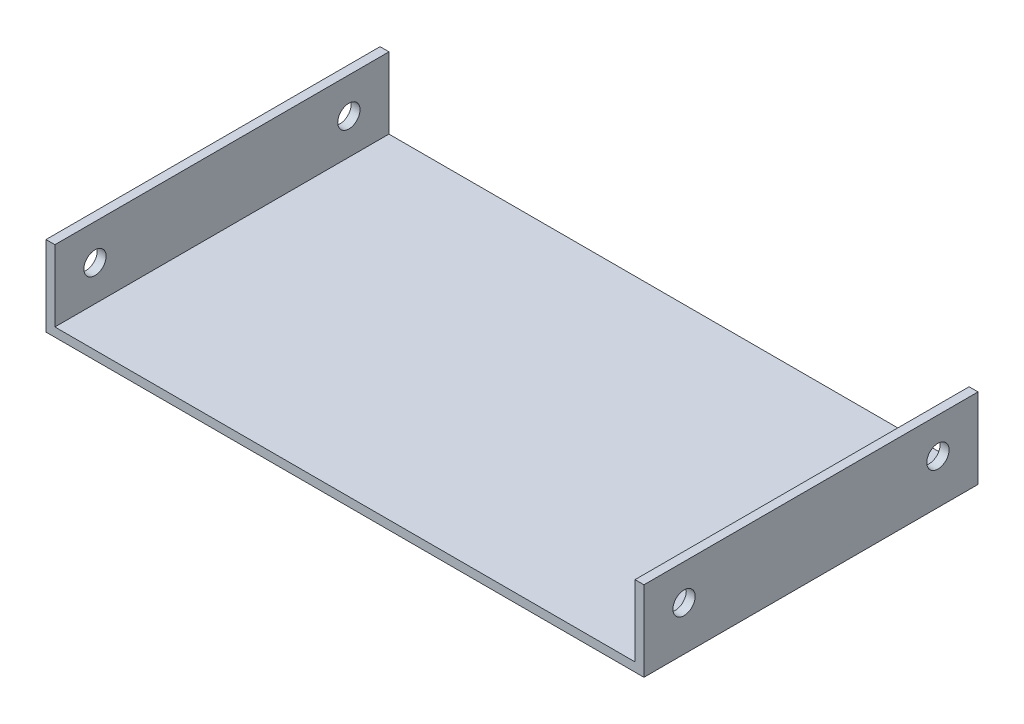
ISO-10303-21;
HEADER;
FILE_DESCRIPTION(('STEP AP214'),'2;1');
FILE_NAME('part.step','',(''),(''),'','','');
FILE_SCHEMA(('AUTOMOTIVE_DESIGN { 1 0 10303 214 1 1 1 1 }'));
ENDSEC;
DATA;
#1=APPLICATION_CONTEXT('core data for automotive mechanical design processes');
#2=APPLICATION_PROTOCOL_DEFINITION('international standard','automotive_design',2000,#1);
#3=PRODUCT_CONTEXT('',#1,'mechanical');
#4=PRODUCT('Part','Part','',(#3));
#5=PRODUCT_RELATED_PRODUCT_CATEGORY('part','',(#4));
#6=PRODUCT_DEFINITION_FORMATION('','',#4);
#7=PRODUCT_DEFINITION_CONTEXT('part definition',#1,'design');
#8=PRODUCT_DEFINITION('design','',#6,#7);
#9=PRODUCT_DEFINITION_SHAPE('','',#8);
#10=(LENGTH_UNIT() NAMED_UNIT(*) SI_UNIT(.MILLI.,.METRE.));
#11=(NAMED_UNIT(*) PLANE_ANGLE_UNIT() SI_UNIT($,.RADIAN.));
#12=(NAMED_UNIT(*) SI_UNIT($,.STERADIAN.) SOLID_ANGLE_UNIT());
#13=UNCERTAINTY_MEASURE_WITH_UNIT(LENGTH_MEASURE(1.E-05),#10,'distance_accuracy_value','');
#14=(GEOMETRIC_REPRESENTATION_CONTEXT(3) GLOBAL_UNCERTAINTY_ASSIGNED_CONTEXT((#13)) GLOBAL_UNIT_ASSIGNED_CONTEXT((#10,
#11,#12)) REPRESENTATION_CONTEXT('',''));
#15=CARTESIAN_POINT('',(0.,0.,0.));
#16=DIRECTION('',(0.,0.,1.));
#17=DIRECTION('',(1.,0.,0.));
#18=AXIS2_PLACEMENT_3D('',#15,#16,#17);
#19=CARTESIAN_POINT('',(-65.125,2.,-37.5));
#20=DIRECTION('',(0.,0.,1.));
#21=DIRECTION('',(1.,0.,0.));
#22=AXIS2_PLACEMENT_3D('',#19,#20,#21);
#23=PLANE('',#22);
#24=DIRECTION('',(-1.,0.,0.));
#25=VECTOR('',#24,1.);
#26=CARTESIAN_POINT('',(-65.125,0.,-37.5));
#27=LINE('',#26,#25);
#28=CARTESIAN_POINT('',(67.125,0.,-37.5));
#29=VERTEX_POINT('',#28);
#30=CARTESIAN_POINT('',(-67.125,0.,-37.5));
#31=VERTEX_POINT('',#30);
#32=EDGE_CURVE('E107',#29,#31,#27,.T.);
#33=ORIENTED_EDGE('',*,*,#32,.T.);
#34=DIRECTION('',(0.,1.,0.));
#35=VECTOR('',#34,1.);
#36=CARTESIAN_POINT('',(-67.125,0.,-37.5));
#37=LINE('',#36,#35);
#38=CARTESIAN_POINT('',(-67.125,18.,-37.5));
#39=VERTEX_POINT('',#38);
#40=EDGE_CURVE('E110',#31,#39,#37,.T.);
#41=ORIENTED_EDGE('',*,*,#40,.T.);
#42=DIRECTION('',(1.,0.,0.));
#43=VECTOR('',#42,1.);
#44=CARTESIAN_POINT('',(-67.125,18.,-37.5));
#45=LINE('',#44,#43);
#46=CARTESIAN_POINT('',(-65.125,18.,-37.5));
#47=VERTEX_POINT('',#46);
#48=EDGE_CURVE('E144',#39,#47,#45,.T.);
#49=ORIENTED_EDGE('',*,*,#48,.T.);
#50=DIRECTION('',(0.,1.,0.));
#51=VECTOR('',#50,1.);
#52=CARTESIAN_POINT('',(-65.125,0.,-37.5));
#53=LINE('',#52,#51);
#54=CARTESIAN_POINT('',(-65.125,2.,-37.5));
#55=VERTEX_POINT('',#54);
#56=EDGE_CURVE('E145',#55,#47,#53,.T.);
#57=ORIENTED_EDGE('',*,*,#56,.F.);
#58=DIRECTION('',(-1.,0.,0.));
#59=VECTOR('',#58,1.);
#60=CARTESIAN_POINT('',(-65.125,2.,-37.5));
#61=LINE('',#60,#59);
#62=CARTESIAN_POINT('',(65.125,2.,-37.5));
#63=VERTEX_POINT('',#62);
#64=EDGE_CURVE('E190',#63,#55,#61,.T.);
#65=ORIENTED_EDGE('',*,*,#64,.F.);
#66=DIRECTION('',(0.,1.,0.));
#67=VECTOR('',#66,1.);
#68=CARTESIAN_POINT('',(65.125,0.,-37.5));
#69=LINE('',#68,#67);
#70=CARTESIAN_POINT('',(65.125,18.,-37.5));
#71=VERTEX_POINT('',#70);
#72=EDGE_CURVE('E64',#63,#71,#69,.T.);
#73=ORIENTED_EDGE('',*,*,#72,.T.);
#74=DIRECTION('',(-1.,0.,0.));
#75=VECTOR('',#74,1.);
#76=CARTESIAN_POINT('',(67.125,18.,-37.5));
#77=LINE('',#76,#75);
#78=CARTESIAN_POINT('',(67.125,18.,-37.5));
#79=VERTEX_POINT('',#78);
#80=EDGE_CURVE('E121',#79,#71,#77,.T.);
#81=ORIENTED_EDGE('',*,*,#80,.F.);
#82=DIRECTION('',(0.,1.,0.));
#83=VECTOR('',#82,1.);
#84=CARTESIAN_POINT('',(67.125,0.,-37.5));
#85=LINE('',#84,#83);
#86=EDGE_CURVE('E114',#29,#79,#85,.T.);
#87=ORIENTED_EDGE('',*,*,#86,.F.);
#88=EDGE_LOOP('',(#33,#41,#49,#57,#65,#73,#81,#87));
#89=FACE_BOUND('',#88,.T.);
#90=ADVANCED_FACE('F39',(#89),#23,.F.);
#91=CARTESIAN_POINT('',(-65.125,2.,37.5));
#92=DIRECTION('',(0.,0.,-1.));
#93=DIRECTION('',(-1.,0.,0.));
#94=AXIS2_PLACEMENT_3D('',#91,#92,#93);
#95=PLANE('',#94);
#96=DIRECTION('',(1.,0.,0.));
#97=VECTOR('',#96,1.);
#98=CARTESIAN_POINT('',(-65.125,0.,37.5));
#99=LINE('',#98,#97);
#100=CARTESIAN_POINT('',(-67.125,0.,37.5));
#101=VERTEX_POINT('',#100);
#102=CARTESIAN_POINT('',(67.125,0.,37.5));
#103=VERTEX_POINT('',#102);
#104=EDGE_CURVE('E120',#101,#103,#99,.T.);
#105=ORIENTED_EDGE('',*,*,#104,.T.);
#106=DIRECTION('',(0.,-1.,0.));
#107=VECTOR('',#106,1.);
#108=CARTESIAN_POINT('',(67.125,0.,37.5));
#109=LINE('',#108,#107);
#110=CARTESIAN_POINT('',(67.125,18.,37.5));
#111=VERTEX_POINT('',#110);
#112=EDGE_CURVE('E164',#111,#103,#109,.T.);
#113=ORIENTED_EDGE('',*,*,#112,.F.);
#114=DIRECTION('',(-1.,0.,0.));
#115=VECTOR('',#114,1.);
#116=CARTESIAN_POINT('',(67.125,18.,37.5));
#117=LINE('',#116,#115);
#118=CARTESIAN_POINT('',(65.125,18.,37.5));
#119=VERTEX_POINT('',#118);
#120=EDGE_CURVE('E171',#111,#119,#117,.T.);
#121=ORIENTED_EDGE('',*,*,#120,.T.);
#122=DIRECTION('',(0.,-1.,0.));
#123=VECTOR('',#122,1.);
#124=CARTESIAN_POINT('',(65.125,0.,37.5));
#125=LINE('',#124,#123);
#126=CARTESIAN_POINT('',(65.125,2.,37.5));
#127=VERTEX_POINT('',#126);
#128=EDGE_CURVE('E161',#119,#127,#125,.T.);
#129=ORIENTED_EDGE('',*,*,#128,.T.);
#130=DIRECTION('',(1.,0.,0.));
#131=VECTOR('',#130,1.);
#132=CARTESIAN_POINT('',(-65.125,2.,37.5));
#133=LINE('',#132,#131);
#134=CARTESIAN_POINT('',(-65.125,2.,37.5));
#135=VERTEX_POINT('',#134);
#136=EDGE_CURVE('E11',#135,#127,#133,.T.);
#137=ORIENTED_EDGE('',*,*,#136,.F.);
#138=DIRECTION('',(0.,-1.,0.));
#139=VECTOR('',#138,1.);
#140=CARTESIAN_POINT('',(-65.125,0.,37.5));
#141=LINE('',#140,#139);
#142=CARTESIAN_POINT('',(-65.125,18.,37.5));
#143=VERTEX_POINT('',#142);
#144=EDGE_CURVE('E56',#143,#135,#141,.T.);
#145=ORIENTED_EDGE('',*,*,#144,.F.);
#146=DIRECTION('',(1.,0.,0.));
#147=VECTOR('',#146,1.);
#148=CARTESIAN_POINT('',(-67.125,18.,37.5));
#149=LINE('',#148,#147);
#150=CARTESIAN_POINT('',(-67.125,18.,37.5));
#151=VERTEX_POINT('',#150);
#152=EDGE_CURVE('E155',#151,#143,#149,.T.);
#153=ORIENTED_EDGE('',*,*,#152,.F.);
#154=DIRECTION('',(0.,-1.,0.));
#155=VECTOR('',#154,1.);
#156=CARTESIAN_POINT('',(-67.125,0.,37.5));
#157=LINE('',#156,#155);
#158=EDGE_CURVE('E136',#151,#101,#157,.T.);
#159=ORIENTED_EDGE('',*,*,#158,.T.);
#160=EDGE_LOOP('',(#105,#113,#121,#129,#137,#145,#153,#159));
#161=FACE_BOUND('',#160,.T.);
#162=ADVANCED_FACE('F251',(#161),#95,.F.);
#163=CARTESIAN_POINT('',(0.,2.,0.));
#164=DIRECTION('',(0.,-1.,0.));
#165=DIRECTION('',(0.,0.,-1.));
#166=AXIS2_PLACEMENT_3D('',#163,#164,#165);
#167=PLANE('',#166);
#168=DIRECTION('',(0.,0.,-1.));
#169=VECTOR('',#168,1.);
#170=CARTESIAN_POINT('',(65.125,2.,37.5));
#171=LINE('',#170,#169);
#172=EDGE_CURVE('E186',#127,#63,#171,.T.);
#173=ORIENTED_EDGE('',*,*,#172,.T.);
#174=ORIENTED_EDGE('',*,*,#64,.T.);
#175=DIRECTION('',(0.,0.,1.));
#176=VECTOR('',#175,1.);
#177=CARTESIAN_POINT('',(-65.125,2.,37.5));
#178=LINE('',#177,#176);
#179=EDGE_CURVE('E48',#55,#135,#178,.T.);
#180=ORIENTED_EDGE('',*,*,#179,.T.);
#181=ORIENTED_EDGE('',*,*,#136,.T.);
#182=EDGE_LOOP('',(#173,#174,#180,#181));
#183=FACE_BOUND('',#182,.T.);
#184=ADVANCED_FACE('F255',(#183),#167,.F.);
#185=CARTESIAN_POINT('',(0.,0.,0.));
#186=DIRECTION('',(0.,-1.,0.));
#187=DIRECTION('',(0.,0.,-1.));
#188=AXIS2_PLACEMENT_3D('',#185,#186,#187);
#189=PLANE('',#188);
#190=ORIENTED_EDGE('',*,*,#32,.F.);
#191=DIRECTION('',(0.,0.,-1.));
#192=VECTOR('',#191,1.);
#193=CARTESIAN_POINT('',(67.125,0.,-37.5));
#194=LINE('',#193,#192);
#195=EDGE_CURVE('E168',#103,#29,#194,.T.);
#196=ORIENTED_EDGE('',*,*,#195,.F.);
#197=ORIENTED_EDGE('',*,*,#104,.F.);
#198=DIRECTION('',(0.,0.,-1.));
#199=VECTOR('',#198,1.);
#200=CARTESIAN_POINT('',(-67.125,0.,-37.5));
#201=LINE('',#200,#199);
#202=EDGE_CURVE('E127',#101,#31,#201,.T.);
#203=ORIENTED_EDGE('',*,*,#202,.T.);
#204=EDGE_LOOP('',(#190,#196,#197,#203));
#205=FACE_BOUND('',#204,.T.);
#206=ADVANCED_FACE('F134',(#205),#189,.T.);
#207=CARTESIAN_POINT('',(67.125,18.,-37.5));
#208=DIRECTION('',(0.,-1.,0.));
#209=DIRECTION('',(0.,0.,-1.));
#210=AXIS2_PLACEMENT_3D('',#207,#208,#209);
#211=PLANE('',#210);
#212=DIRECTION('',(0.,0.,1.));
#213=VECTOR('',#212,1.);
#214=CARTESIAN_POINT('',(65.125,18.,-37.5));
#215=LINE('',#214,#213);
#216=EDGE_CURVE('E174',#71,#119,#215,.T.);
#217=ORIENTED_EDGE('',*,*,#216,.T.);
#218=ORIENTED_EDGE('',*,*,#120,.F.);
#219=DIRECTION('',(0.,0.,1.));
#220=VECTOR('',#219,1.);
#221=CARTESIAN_POINT('',(67.125,18.,-37.5));
#222=LINE('',#221,#220);
#223=EDGE_CURVE('E160',#79,#111,#222,.T.);
#224=ORIENTED_EDGE('',*,*,#223,.F.);
#225=ORIENTED_EDGE('',*,*,#80,.T.);
#226=EDGE_LOOP('',(#217,#218,#224,#225));
#227=FACE_BOUND('',#226,.T.);
#228=ADVANCED_FACE('F264',(#227),#211,.F.);
#229=CARTESIAN_POINT('',(67.125,0.,0.));
#230=DIRECTION('',(1.,0.,0.));
#231=DIRECTION('',(0.,0.,-1.));
#232=AXIS2_PLACEMENT_3D('',#229,#230,#231);
#233=PLANE('',#232);
#234=CARTESIAN_POINT('',(67.125,10.,-28.5));
#235=DIRECTION('',(-1.,0.,0.));
#236=DIRECTION('',(0.,0.,1.));
#237=AXIS2_PLACEMENT_3D('',#234,#235,#236);
#238=CIRCLE('',#237,2.5);
#239=CARTESIAN_POINT('',(67.125,10.,-26.));
#240=VERTEX_POINT('',#239);
#241=EDGE_CURVE('E201',#240,#240,#238,.T.);
#242=ORIENTED_EDGE('',*,*,#241,.T.);
#243=EDGE_LOOP('',(#242));
#244=FACE_BOUND('',#243,.T.);
#245=CARTESIAN_POINT('',(67.125,10.,28.5));
#246=DIRECTION('',(-1.,0.,0.));
#247=DIRECTION('',(0.,0.,-1.));
#248=AXIS2_PLACEMENT_3D('',#245,#246,#247);
#249=CIRCLE('',#248,2.5);
#250=CARTESIAN_POINT('',(67.125,10.,26.));
#251=VERTEX_POINT('',#250);
#252=EDGE_CURVE('E215',#251,#251,#249,.T.);
#253=ORIENTED_EDGE('',*,*,#252,.T.);
#254=EDGE_LOOP('',(#253));
#255=FACE_BOUND('',#254,.T.);
#256=ORIENTED_EDGE('',*,*,#86,.T.);
#257=ORIENTED_EDGE('',*,*,#223,.T.);
#258=ORIENTED_EDGE('',*,*,#112,.T.);
#259=ORIENTED_EDGE('',*,*,#195,.T.);
#260=EDGE_LOOP('',(#256,#257,#258,#259));
#261=FACE_BOUND('',#260,.T.);
#262=ADVANCED_FACE('F268',(#244,#255,#261),#233,.T.);
#263=CARTESIAN_POINT('',(65.125,0.,0.));
#264=DIRECTION('',(1.,0.,0.));
#265=DIRECTION('',(0.,0.,-1.));
#266=AXIS2_PLACEMENT_3D('',#263,#264,#265);
#267=PLANE('',#266);
#268=CARTESIAN_POINT('',(65.125,10.,-28.5));
#269=DIRECTION('',(1.,0.,0.));
#270=DIRECTION('',(0.,0.,-1.));
#271=AXIS2_PLACEMENT_3D('',#268,#269,#270);
#272=CIRCLE('',#271,2.5);
#273=CARTESIAN_POINT('',(65.125,10.,-31.));
#274=VERTEX_POINT('',#273);
#275=EDGE_CURVE('E148',#274,#274,#272,.T.);
#276=ORIENTED_EDGE('',*,*,#275,.T.);
#277=EDGE_LOOP('',(#276));
#278=FACE_BOUND('',#277,.T.);
#279=CARTESIAN_POINT('',(65.125,10.,28.5));
#280=DIRECTION('',(1.,0.,0.));
#281=DIRECTION('',(0.,0.,-1.));
#282=AXIS2_PLACEMENT_3D('',#279,#280,#281);
#283=CIRCLE('',#282,2.5);
#284=CARTESIAN_POINT('',(65.125,10.,26.));
#285=VERTEX_POINT('',#284);
#286=EDGE_CURVE('E200',#285,#285,#283,.T.);
#287=ORIENTED_EDGE('',*,*,#286,.T.);
#288=EDGE_LOOP('',(#287));
#289=FACE_BOUND('',#288,.T.);
#290=ORIENTED_EDGE('',*,*,#172,.F.);
#291=ORIENTED_EDGE('',*,*,#128,.F.);
#292=ORIENTED_EDGE('',*,*,#216,.F.);
#293=ORIENTED_EDGE('',*,*,#72,.F.);
#294=EDGE_LOOP('',(#290,#291,#292,#293));
#295=FACE_BOUND('',#294,.T.);
#296=ADVANCED_FACE('F270',(#278,#289,#295),#267,.F.);
#297=CARTESIAN_POINT('',(-67.125,18.,-37.5));
#298=DIRECTION('',(0.,1.,0.));
#299=DIRECTION('',(0.,0.,1.));
#300=AXIS2_PLACEMENT_3D('',#297,#298,#299);
#301=PLANE('',#300);
#302=DIRECTION('',(0.,0.,1.));
#303=VECTOR('',#302,1.);
#304=CARTESIAN_POINT('',(-65.125,18.,-37.5));
#305=LINE('',#304,#303);
#306=EDGE_CURVE('E132',#47,#143,#305,.T.);
#307=ORIENTED_EDGE('',*,*,#306,.F.);
#308=ORIENTED_EDGE('',*,*,#48,.F.);
#309=DIRECTION('',(0.,0.,1.));
#310=VECTOR('',#309,1.);
#311=CARTESIAN_POINT('',(-67.125,18.,-37.5));
#312=LINE('',#311,#310);
#313=EDGE_CURVE('E130',#39,#151,#312,.T.);
#314=ORIENTED_EDGE('',*,*,#313,.T.);
#315=ORIENTED_EDGE('',*,*,#152,.T.);
#316=EDGE_LOOP('',(#307,#308,#314,#315));
#317=FACE_BOUND('',#316,.T.);
#318=ADVANCED_FACE('F273',(#317),#301,.T.);
#319=CARTESIAN_POINT('',(-67.125,0.,0.));
#320=DIRECTION('',(-1.,0.,0.));
#321=DIRECTION('',(0.,0.,-1.));
#322=AXIS2_PLACEMENT_3D('',#319,#320,#321);
#323=PLANE('',#322);
#324=CARTESIAN_POINT('',(-67.125,10.,-28.5));
#325=DIRECTION('',(-1.,0.,0.));
#326=DIRECTION('',(0.,0.,1.));
#327=AXIS2_PLACEMENT_3D('',#324,#325,#326);
#328=CIRCLE('',#327,2.5);
#329=CARTESIAN_POINT('',(-67.125,10.,-26.));
#330=VERTEX_POINT('',#329);
#331=EDGE_CURVE('E209',#330,#330,#328,.T.);
#332=ORIENTED_EDGE('',*,*,#331,.F.);
#333=EDGE_LOOP('',(#332));
#334=FACE_BOUND('',#333,.T.);
#335=CARTESIAN_POINT('',(-67.125,10.,28.5));
#336=DIRECTION('',(-1.,0.,0.));
#337=DIRECTION('',(0.,0.,-1.));
#338=AXIS2_PLACEMENT_3D('',#335,#336,#337);
#339=CIRCLE('',#338,2.5);
#340=CARTESIAN_POINT('',(-67.125,10.,26.));
#341=VERTEX_POINT('',#340);
#342=EDGE_CURVE('E221',#341,#341,#339,.T.);
#343=ORIENTED_EDGE('',*,*,#342,.F.);
#344=EDGE_LOOP('',(#343));
#345=FACE_BOUND('',#344,.T.);
#346=ORIENTED_EDGE('',*,*,#40,.F.);
#347=ORIENTED_EDGE('',*,*,#202,.F.);
#348=ORIENTED_EDGE('',*,*,#158,.F.);
#349=ORIENTED_EDGE('',*,*,#313,.F.);
#350=EDGE_LOOP('',(#346,#347,#348,#349));
#351=FACE_BOUND('',#350,.T.);
#352=ADVANCED_FACE('F125',(#334,#345,#351),#323,.T.);
#353=CARTESIAN_POINT('',(-65.125,0.,0.));
#354=DIRECTION('',(-1.,0.,0.));
#355=DIRECTION('',(0.,0.,-1.));
#356=AXIS2_PLACEMENT_3D('',#353,#354,#355);
#357=PLANE('',#356);
#358=CARTESIAN_POINT('',(-65.125,10.,-28.5));
#359=DIRECTION('',(-1.,0.,0.));
#360=DIRECTION('',(0.,0.,1.));
#361=AXIS2_PLACEMENT_3D('',#358,#359,#360);
#362=CIRCLE('',#361,2.5);
#363=CARTESIAN_POINT('',(-65.125,10.,-26.));
#364=VERTEX_POINT('',#363);
#365=EDGE_CURVE('E42',#364,#364,#362,.T.);
#366=ORIENTED_EDGE('',*,*,#365,.T.);
#367=EDGE_LOOP('',(#366));
#368=FACE_BOUND('',#367,.T.);
#369=CARTESIAN_POINT('',(-65.125,10.,28.5));
#370=DIRECTION('',(-1.,0.,0.));
#371=DIRECTION('',(0.,0.,1.));
#372=AXIS2_PLACEMENT_3D('',#369,#370,#371);
#373=CIRCLE('',#372,2.5);
#374=CARTESIAN_POINT('',(-65.125,10.,31.));
#375=VERTEX_POINT('',#374);
#376=EDGE_CURVE('E197',#375,#375,#373,.T.);
#377=ORIENTED_EDGE('',*,*,#376,.T.);
#378=EDGE_LOOP('',(#377));
#379=FACE_BOUND('',#378,.T.);
#380=ORIENTED_EDGE('',*,*,#179,.F.);
#381=ORIENTED_EDGE('',*,*,#56,.T.);
#382=ORIENTED_EDGE('',*,*,#306,.T.);
#383=ORIENTED_EDGE('',*,*,#144,.T.);
#384=EDGE_LOOP('',(#380,#381,#382,#383));
#385=FACE_BOUND('',#384,.T.);
#386=ADVANCED_FACE('F232',(#368,#379,#385),#357,.F.);
#387=CARTESIAN_POINT('',(67.125,10.,28.5));
#388=DIRECTION('',(-1.,0.,0.));
#389=DIRECTION('',(0.,0.,1.));
#390=AXIS2_PLACEMENT_3D('',#387,#388,#389);
#391=CYLINDRICAL_SURFACE('',#390,2.5);
#392=ORIENTED_EDGE('',*,*,#342,.T.);
#393=EDGE_LOOP('',(#392));
#394=FACE_BOUND('',#393,.T.);
#395=ORIENTED_EDGE('',*,*,#376,.F.);
#396=EDGE_LOOP('',(#395));
#397=FACE_BOUND('',#396,.T.);
#398=ADVANCED_FACE('F237',(#394,#397),#391,.F.);
#399=CARTESIAN_POINT('',(67.125,10.,-28.5));
#400=DIRECTION('',(-1.,0.,0.));
#401=DIRECTION('',(0.,0.,1.));
#402=AXIS2_PLACEMENT_3D('',#399,#400,#401);
#403=CYLINDRICAL_SURFACE('',#402,2.5);
#404=ORIENTED_EDGE('',*,*,#331,.T.);
#405=EDGE_LOOP('',(#404));
#406=FACE_BOUND('',#405,.T.);
#407=ORIENTED_EDGE('',*,*,#365,.F.);
#408=EDGE_LOOP('',(#407));
#409=FACE_BOUND('',#408,.T.);
#410=ADVANCED_FACE('F234',(#406,#409),#403,.F.);
#411=ORIENTED_EDGE('',*,*,#252,.F.);
#412=EDGE_LOOP('',(#411));
#413=FACE_BOUND('',#412,.T.);
#414=ORIENTED_EDGE('',*,*,#286,.F.);
#415=EDGE_LOOP('',(#414));
#416=FACE_BOUND('',#415,.T.);
#417=ADVANCED_FACE('F236',(#413,#416),#391,.F.);
#418=ORIENTED_EDGE('',*,*,#241,.F.);
#419=EDGE_LOOP('',(#418));
#420=FACE_BOUND('',#419,.T.);
#421=ORIENTED_EDGE('',*,*,#275,.F.);
#422=EDGE_LOOP('',(#421));
#423=FACE_BOUND('',#422,.T.);
#424=ADVANCED_FACE('F240',(#420,#423),#403,.F.);
#425=CLOSED_SHELL('',(#90,#162,#184,#206,#228,#262,#296,#318,#352,#386,#398,#410,#417,#424));
#426=MANIFOLD_SOLID_BREP('B2',#425);
#427=ADVANCED_BREP_SHAPE_REPRESENTATION('',(#18,#426),#14);
#428=SHAPE_DEFINITION_REPRESENTATION(#9,#427);
ENDSEC;
END-ISO-10303-21;
